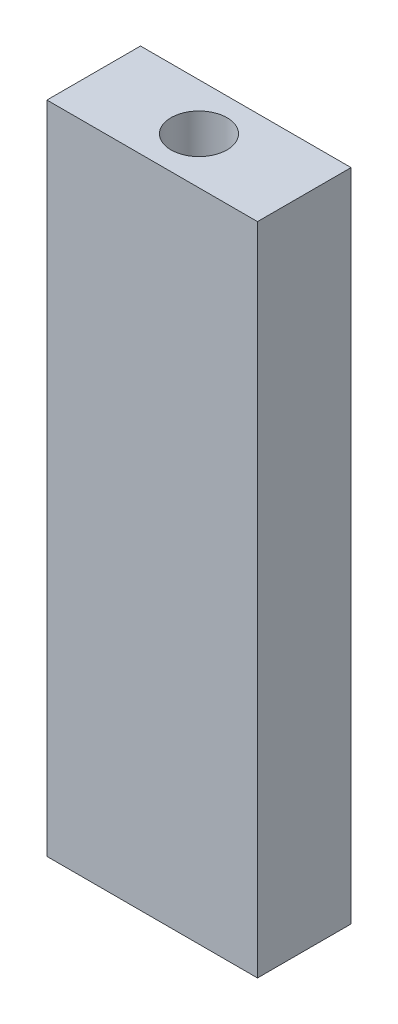
ISO-10303-21;
HEADER;
FILE_DESCRIPTION(('STEP AP214'),'2;1');
FILE_NAME('part.step','',(''),(''),'','','');
FILE_SCHEMA(('AUTOMOTIVE_DESIGN { 1 0 10303 214 1 1 1 1 }'));
ENDSEC;
DATA;
#1=APPLICATION_CONTEXT('core data for automotive mechanical design processes');
#2=APPLICATION_PROTOCOL_DEFINITION('international standard','automotive_design',2000,#1);
#3=PRODUCT_CONTEXT('',#1,'mechanical');
#4=PRODUCT('Part','Part','',(#3));
#5=PRODUCT_RELATED_PRODUCT_CATEGORY('part','',(#4));
#6=PRODUCT_DEFINITION_FORMATION('','',#4);
#7=PRODUCT_DEFINITION_CONTEXT('part definition',#1,'design');
#8=PRODUCT_DEFINITION('design','',#6,#7);
#9=PRODUCT_DEFINITION_SHAPE('','',#8);
#10=(LENGTH_UNIT() NAMED_UNIT(*) SI_UNIT(.MILLI.,.METRE.));
#11=(NAMED_UNIT(*) PLANE_ANGLE_UNIT() SI_UNIT($,.RADIAN.));
#12=(NAMED_UNIT(*) SI_UNIT($,.STERADIAN.) SOLID_ANGLE_UNIT());
#13=UNCERTAINTY_MEASURE_WITH_UNIT(LENGTH_MEASURE(1.E-05),#10,'distance_accuracy_value','');
#14=(GEOMETRIC_REPRESENTATION_CONTEXT(3) GLOBAL_UNCERTAINTY_ASSIGNED_CONTEXT((#13)) GLOBAL_UNIT_ASSIGNED_CONTEXT((#10,
#11,#12)) REPRESENTATION_CONTEXT('',''));
#15=CARTESIAN_POINT('',(0.,0.,0.));
#16=DIRECTION('',(0.,0.,1.));
#17=DIRECTION('',(1.,0.,0.));
#18=AXIS2_PLACEMENT_3D('',#15,#16,#17);
#19=CARTESIAN_POINT('',(-53.1168281653747,44.45,-36.7917312661499));
#20=DIRECTION('',(1.,0.,0.));
#21=DIRECTION('',(0.,0.,-1.));
#22=AXIS2_PLACEMENT_3D('',#19,#20,#21);
#23=PLANE('',#22);
#24=DIRECTION('',(0.,0.,1.));
#25=VECTOR('',#24,1.);
#26=CARTESIAN_POINT('',(-53.1168281653747,0.,-36.7917312661499));
#27=LINE('',#26,#25);
#28=CARTESIAN_POINT('',(-53.1168281653747,0.,-36.7917312661499));
#29=VERTEX_POINT('',#28);
#30=CARTESIAN_POINT('',(-53.1168281653747,0.,-30.4417312661499));
#31=VERTEX_POINT('',#30);
#32=EDGE_CURVE('E107',#29,#31,#27,.T.);
#33=ORIENTED_EDGE('',*,*,#32,.T.);
#34=DIRECTION('',(0.,-1.,0.));
#35=VECTOR('',#34,1.);
#36=CARTESIAN_POINT('',(-53.1168281653747,44.45,-30.4417312661499));
#37=LINE('',#36,#35);
#38=CARTESIAN_POINT('',(-53.1168281653747,44.45,-30.4417312661499));
#39=VERTEX_POINT('',#38);
#40=EDGE_CURVE('E11',#39,#31,#37,.T.);
#41=ORIENTED_EDGE('',*,*,#40,.F.);
#42=DIRECTION('',(0.,0.,1.));
#43=VECTOR('',#42,1.);
#44=CARTESIAN_POINT('',(-53.1168281653747,44.45,-36.7917312661499));
#45=LINE('',#44,#43);
#46=CARTESIAN_POINT('',(-53.1168281653747,44.45,-36.7917312661499));
#47=VERTEX_POINT('',#46);
#48=EDGE_CURVE('E108',#47,#39,#45,.T.);
#49=ORIENTED_EDGE('',*,*,#48,.F.);
#50=DIRECTION('',(0.,-1.,0.));
#51=VECTOR('',#50,1.);
#52=CARTESIAN_POINT('',(-53.1168281653747,44.45,-36.7917312661499));
#53=LINE('',#52,#51);
#54=EDGE_CURVE('E114',#47,#29,#53,.T.);
#55=ORIENTED_EDGE('',*,*,#54,.T.);
#56=EDGE_LOOP('',(#33,#41,#49,#55));
#57=FACE_BOUND('',#56,.T.);
#58=ADVANCED_FACE('F32',(#57),#23,.F.);
#59=CARTESIAN_POINT('',(-53.1168281653747,44.45,-30.4417312661499));
#60=DIRECTION('',(0.,0.,-1.));
#61=DIRECTION('',(-1.,0.,0.));
#62=AXIS2_PLACEMENT_3D('',#59,#60,#61);
#63=PLANE('',#62);
#64=DIRECTION('',(1.,0.,0.));
#65=VECTOR('',#64,1.);
#66=CARTESIAN_POINT('',(-53.1168281653747,0.,-30.4417312661499));
#67=LINE('',#66,#65);
#68=CARTESIAN_POINT('',(-38.8293281653747,0.,-30.4417312661499));
#69=VERTEX_POINT('',#68);
#70=EDGE_CURVE('E117',#31,#69,#67,.T.);
#71=ORIENTED_EDGE('',*,*,#70,.T.);
#72=DIRECTION('',(0.,-1.,0.));
#73=VECTOR('',#72,1.);
#74=CARTESIAN_POINT('',(-38.8293281653747,44.45,-30.4417312661499));
#75=LINE('',#74,#73);
#76=CARTESIAN_POINT('',(-38.8293281653747,44.45,-30.4417312661499));
#77=VERTEX_POINT('',#76);
#78=EDGE_CURVE('E40',#77,#69,#75,.T.);
#79=ORIENTED_EDGE('',*,*,#78,.F.);
#80=DIRECTION('',(1.,0.,0.));
#81=VECTOR('',#80,1.);
#82=CARTESIAN_POINT('',(-53.1168281653747,44.45,-30.4417312661499));
#83=LINE('',#82,#81);
#84=EDGE_CURVE('E79',#39,#77,#83,.T.);
#85=ORIENTED_EDGE('',*,*,#84,.F.);
#86=ORIENTED_EDGE('',*,*,#40,.T.);
#87=EDGE_LOOP('',(#71,#79,#85,#86));
#88=FACE_BOUND('',#87,.T.);
#89=ADVANCED_FACE('F141',(#88),#63,.F.);
#90=CARTESIAN_POINT('',(-38.8293281653747,44.45,-36.7917312661499));
#91=DIRECTION('',(-1.,0.,0.));
#92=DIRECTION('',(0.,0.,1.));
#93=AXIS2_PLACEMENT_3D('',#90,#91,#92);
#94=PLANE('',#93);
#95=DIRECTION('',(0.,0.,-1.));
#96=VECTOR('',#95,1.);
#97=CARTESIAN_POINT('',(-38.8293281653747,0.,-36.7917312661499));
#98=LINE('',#97,#96);
#99=CARTESIAN_POINT('',(-38.8293281653747,0.,-36.7917312661499));
#100=VERTEX_POINT('',#99);
#101=EDGE_CURVE('E66',#69,#100,#98,.T.);
#102=ORIENTED_EDGE('',*,*,#101,.T.);
#103=DIRECTION('',(0.,-1.,0.));
#104=VECTOR('',#103,1.);
#105=CARTESIAN_POINT('',(-38.8293281653747,44.45,-36.7917312661499));
#106=LINE('',#105,#104);
#107=CARTESIAN_POINT('',(-38.8293281653747,44.45,-36.7917312661499));
#108=VERTEX_POINT('',#107);
#109=EDGE_CURVE('E122',#108,#100,#106,.T.);
#110=ORIENTED_EDGE('',*,*,#109,.F.);
#111=DIRECTION('',(0.,0.,-1.));
#112=VECTOR('',#111,1.);
#113=CARTESIAN_POINT('',(-38.8293281653747,44.45,-36.7917312661499));
#114=LINE('',#113,#112);
#115=EDGE_CURVE('E111',#77,#108,#114,.T.);
#116=ORIENTED_EDGE('',*,*,#115,.F.);
#117=ORIENTED_EDGE('',*,*,#78,.T.);
#118=EDGE_LOOP('',(#102,#110,#116,#117));
#119=FACE_BOUND('',#118,.T.);
#120=ADVANCED_FACE('F124',(#119),#94,.F.);
#121=CARTESIAN_POINT('',(-53.1168281653747,44.45,-36.7917312661499));
#122=DIRECTION('',(0.,0.,1.));
#123=DIRECTION('',(1.,0.,0.));
#124=AXIS2_PLACEMENT_3D('',#121,#122,#123);
#125=PLANE('',#124);
#126=DIRECTION('',(-1.,0.,0.));
#127=VECTOR('',#126,1.);
#128=CARTESIAN_POINT('',(-53.1168281653747,0.,-36.7917312661499));
#129=LINE('',#128,#127);
#130=EDGE_CURVE('E72',#100,#29,#129,.T.);
#131=ORIENTED_EDGE('',*,*,#130,.T.);
#132=ORIENTED_EDGE('',*,*,#54,.F.);
#133=DIRECTION('',(-1.,0.,0.));
#134=VECTOR('',#133,1.);
#135=CARTESIAN_POINT('',(-53.1168281653747,44.45,-36.7917312661499));
#136=LINE('',#135,#134);
#137=EDGE_CURVE('E48',#108,#47,#136,.T.);
#138=ORIENTED_EDGE('',*,*,#137,.F.);
#139=ORIENTED_EDGE('',*,*,#109,.T.);
#140=EDGE_LOOP('',(#131,#132,#138,#139));
#141=FACE_BOUND('',#140,.T.);
#142=ADVANCED_FACE('F131',(#141),#125,.F.);
#143=CARTESIAN_POINT('',(-53.1168281653747,44.45,-30.4417312661499));
#144=DIRECTION('',(0.,1.,0.));
#145=DIRECTION('',(0.,0.,1.));
#146=AXIS2_PLACEMENT_3D('',#143,#144,#145);
#147=PLANE('',#146);
#148=CARTESIAN_POINT('',(-45.9730781653747,44.45,-33.6167312661499));
#149=DIRECTION('',(0.,1.,0.));
#150=DIRECTION('',(0.,0.,1.));
#151=AXIS2_PLACEMENT_3D('',#148,#149,#150);
#152=CIRCLE('',#151,1.89864999999999);
#153=CARTESIAN_POINT('',(-45.9730781653747,44.45,-31.7180812661499));
#154=VERTEX_POINT('',#153);
#155=EDGE_CURVE('E96',#154,#154,#152,.T.);
#156=ORIENTED_EDGE('',*,*,#155,.F.);
#157=EDGE_LOOP('',(#156));
#158=FACE_BOUND('',#157,.T.);
#159=ORIENTED_EDGE('',*,*,#48,.T.);
#160=ORIENTED_EDGE('',*,*,#84,.T.);
#161=ORIENTED_EDGE('',*,*,#115,.T.);
#162=ORIENTED_EDGE('',*,*,#137,.T.);
#163=EDGE_LOOP('',(#159,#160,#161,#162));
#164=FACE_BOUND('',#163,.T.);
#165=ADVANCED_FACE('F133',(#158,#164),#147,.T.);
#166=CARTESIAN_POINT('',(-53.1168281653747,0.,-30.4417312661499));
#167=DIRECTION('',(0.,1.,0.));
#168=DIRECTION('',(0.,0.,1.));
#169=AXIS2_PLACEMENT_3D('',#166,#167,#168);
#170=PLANE('',#169);
#171=CARTESIAN_POINT('',(-45.9730781653747,0.,-33.6167312661499));
#172=DIRECTION('',(0.,-1.,0.));
#173=DIRECTION('',(0.,0.,-1.));
#174=AXIS2_PLACEMENT_3D('',#171,#172,#173);
#175=CIRCLE('',#174,1.89864999999999);
#176=CARTESIAN_POINT('',(-45.9730781653747,0.,-35.5153812661499));
#177=VERTEX_POINT('',#176);
#178=EDGE_CURVE('E97',#177,#177,#175,.T.);
#179=ORIENTED_EDGE('',*,*,#178,.F.);
#180=EDGE_LOOP('',(#179));
#181=FACE_BOUND('',#180,.T.);
#182=ORIENTED_EDGE('',*,*,#32,.F.);
#183=ORIENTED_EDGE('',*,*,#130,.F.);
#184=ORIENTED_EDGE('',*,*,#101,.F.);
#185=ORIENTED_EDGE('',*,*,#70,.F.);
#186=EDGE_LOOP('',(#182,#183,#184,#185));
#187=FACE_BOUND('',#186,.T.);
#188=ADVANCED_FACE('F127',(#181,#187),#170,.F.);
#189=CARTESIAN_POINT('',(-45.9730781653747,38.1,-33.6167312661499));
#190=DIRECTION('',(0.,1.,0.));
#191=DIRECTION('',(0.,0.,1.));
#192=AXIS2_PLACEMENT_3D('',#189,#190,#191);
#193=CONICAL_SURFACE('',#192,1.89864999999999,1.02974425867665);
#194=CARTESIAN_POINT('',(-45.9730781653747,36.9591759856833,-33.6167312661499));
#195=VERTEX_POINT('',#194);
#196=VERTEX_LOOP('',#195);
#197=FACE_BOUND('',#196,.T.);
#198=CARTESIAN_POINT('',(-45.9730781653747,38.1,-33.6167312661499));
#199=DIRECTION('',(0.,1.,0.));
#200=DIRECTION('',(0.,0.,1.));
#201=AXIS2_PLACEMENT_3D('',#198,#199,#200);
#202=CIRCLE('',#201,1.89864999999999);
#203=CARTESIAN_POINT('',(-45.9730781653747,38.1,-31.7180812661499));
#204=VERTEX_POINT('',#203);
#205=EDGE_CURVE('E100',#204,#204,#202,.T.);
#206=ORIENTED_EDGE('',*,*,#205,.T.);
#207=EDGE_LOOP('',(#206));
#208=FACE_BOUND('',#207,.T.);
#209=ADVANCED_FACE('F171',(#197,#208),#193,.F.);
#210=CARTESIAN_POINT('',(-45.9730781653747,44.45,-33.6167312661499));
#211=DIRECTION('',(0.,1.,0.));
#212=DIRECTION('',(0.,0.,1.));
#213=AXIS2_PLACEMENT_3D('',#210,#211,#212);
#214=CYLINDRICAL_SURFACE('',#213,1.89864999999999);
#215=ORIENTED_EDGE('',*,*,#205,.F.);
#216=EDGE_LOOP('',(#215));
#217=FACE_BOUND('',#216,.T.);
#218=ORIENTED_EDGE('',*,*,#155,.T.);
#219=EDGE_LOOP('',(#218));
#220=FACE_BOUND('',#219,.T.);
#221=ADVANCED_FACE('F90',(#217,#220),#214,.F.);
#222=CARTESIAN_POINT('',(-45.9730781653747,6.34999999999999,-33.6167312661499));
#223=DIRECTION('',(0.,-1.,0.));
#224=DIRECTION('',(0.,0.,-1.));
#225=AXIS2_PLACEMENT_3D('',#222,#223,#224);
#226=CONICAL_SURFACE('',#225,1.89864999999999,1.02974425867665);
#227=CARTESIAN_POINT('',(-45.9730781653747,7.49082401431667,-33.6167312661499));
#228=VERTEX_POINT('',#227);
#229=VERTEX_LOOP('',#228);
#230=FACE_BOUND('',#229,.T.);
#231=CARTESIAN_POINT('',(-45.9730781653747,6.34999999999999,-33.6167312661499));
#232=DIRECTION('',(0.,-1.,0.));
#233=DIRECTION('',(0.,0.,-1.));
#234=AXIS2_PLACEMENT_3D('',#231,#232,#233);
#235=CIRCLE('',#234,1.89864999999999);
#236=CARTESIAN_POINT('',(-45.9730781653747,6.34999999999999,-35.5153812661499));
#237=VERTEX_POINT('',#236);
#238=EDGE_CURVE('E94',#237,#237,#235,.T.);
#239=ORIENTED_EDGE('',*,*,#238,.T.);
#240=EDGE_LOOP('',(#239));
#241=FACE_BOUND('',#240,.T.);
#242=ADVANCED_FACE('F86',(#230,#241),#226,.F.);
#243=CARTESIAN_POINT('',(-45.9730781653747,0.,-33.6167312661499));
#244=DIRECTION('',(0.,-1.,0.));
#245=DIRECTION('',(0.,0.,-1.));
#246=AXIS2_PLACEMENT_3D('',#243,#244,#245);
#247=CYLINDRICAL_SURFACE('',#246,1.89864999999999);
#248=ORIENTED_EDGE('',*,*,#238,.F.);
#249=EDGE_LOOP('',(#248));
#250=FACE_BOUND('',#249,.T.);
#251=ORIENTED_EDGE('',*,*,#178,.T.);
#252=EDGE_LOOP('',(#251));
#253=FACE_BOUND('',#252,.T.);
#254=ADVANCED_FACE('F89',(#250,#253),#247,.F.);
#255=CLOSED_SHELL('',(#58,#89,#120,#142,#165,#188,#209,#221,#242,#254));
#256=MANIFOLD_SOLID_BREP('B2',#255);
#257=ADVANCED_BREP_SHAPE_REPRESENTATION('',(#18,#256),#14);
#258=SHAPE_DEFINITION_REPRESENTATION(#9,#257);
ENDSEC;
END-ISO-10303-21;
